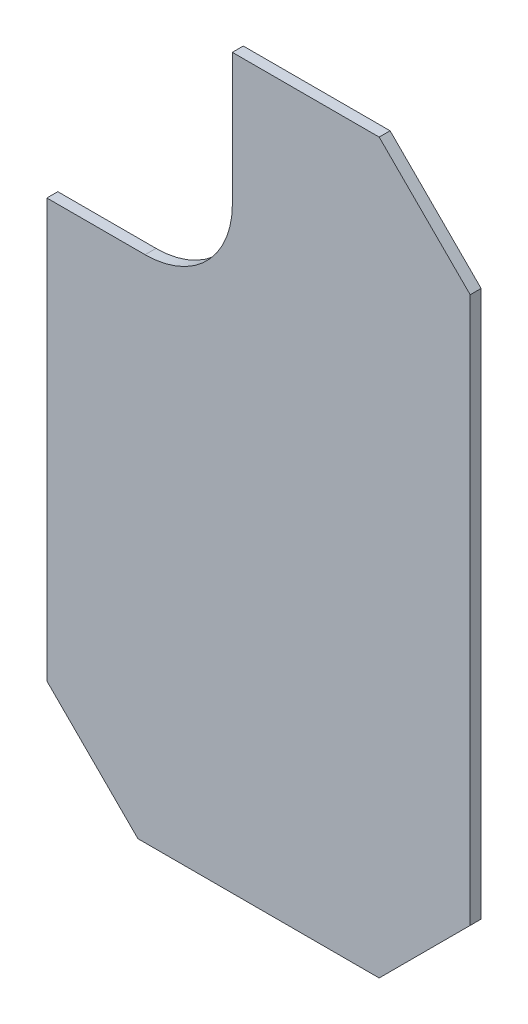
ISO-10303-21;
HEADER;
FILE_DESCRIPTION(('STEP AP214'),'2;1');
FILE_NAME('part.step','',(''),(''),'','','');
FILE_SCHEMA(('AUTOMOTIVE_DESIGN { 1 0 10303 214 1 1 1 1 }'));
ENDSEC;
DATA;
#1=APPLICATION_CONTEXT('core data for automotive mechanical design processes');
#2=APPLICATION_PROTOCOL_DEFINITION('international standard','automotive_design',2000,#1);
#3=PRODUCT_CONTEXT('',#1,'mechanical');
#4=PRODUCT('Part','Part','',(#3));
#5=PRODUCT_RELATED_PRODUCT_CATEGORY('part','',(#4));
#6=PRODUCT_DEFINITION_FORMATION('','',#4);
#7=PRODUCT_DEFINITION_CONTEXT('part definition',#1,'design');
#8=PRODUCT_DEFINITION('design','',#6,#7);
#9=PRODUCT_DEFINITION_SHAPE('','',#8);
#10=(LENGTH_UNIT() NAMED_UNIT(*) SI_UNIT(.MILLI.,.METRE.));
#11=(NAMED_UNIT(*) PLANE_ANGLE_UNIT() SI_UNIT($,.RADIAN.));
#12=(NAMED_UNIT(*) SI_UNIT($,.STERADIAN.) SOLID_ANGLE_UNIT());
#13=UNCERTAINTY_MEASURE_WITH_UNIT(LENGTH_MEASURE(1.E-05),#10,'distance_accuracy_value','');
#14=(GEOMETRIC_REPRESENTATION_CONTEXT(3) GLOBAL_UNCERTAINTY_ASSIGNED_CONTEXT((#13)) GLOBAL_UNIT_ASSIGNED_CONTEXT((#10,
#11,#12)) REPRESENTATION_CONTEXT('',''));
#15=CARTESIAN_POINT('',(0.,0.,0.));
#16=DIRECTION('',(0.,0.,1.));
#17=DIRECTION('',(1.,0.,0.));
#18=AXIS2_PLACEMENT_3D('',#15,#16,#17);
#19=CARTESIAN_POINT('',(-44.8224999999998,-89.4160782442633,0.762));
#20=DIRECTION('',(-0.707106781186544,0.70710678118655,0.));
#21=DIRECTION('',(-0.707106781186551,-0.707106781186544,0.));
#22=AXIS2_PLACEMENT_3D('',#19,#20,#21);
#23=PLANE('',#22);
#24=DIRECTION('',(0.707106781186551,0.707106781186544,0.));
#25=VECTOR('',#24,1.);
#26=CARTESIAN_POINT('',(-44.8224999999998,-89.4160782442633,0.));
#27=LINE('',#26,#25);
#28=CARTESIAN_POINT('',(-51.1724999999998,-95.7660782442633,0.));
#29=VERTEX_POINT('',#28);
#30=CARTESIAN_POINT('',(-44.8224999999998,-89.4160782442633,0.));
#31=VERTEX_POINT('',#30);
#32=EDGE_CURVE('E141',#29,#31,#27,.T.);
#33=ORIENTED_EDGE('',*,*,#32,.T.);
#34=DIRECTION('',(0.,0.,-1.));
#35=VECTOR('',#34,1.);
#36=CARTESIAN_POINT('',(-44.8224999999998,-89.4160782442633,0.762));
#37=LINE('',#36,#35);
#38=CARTESIAN_POINT('',(-44.8224999999998,-89.4160782442633,0.762));
#39=VERTEX_POINT('',#38);
#40=EDGE_CURVE('E11',#39,#31,#37,.T.);
#41=ORIENTED_EDGE('',*,*,#40,.F.);
#42=DIRECTION('',(0.707106781186551,0.707106781186544,0.));
#43=VECTOR('',#42,1.);
#44=CARTESIAN_POINT('',(-44.8224999999998,-89.4160782442633,0.762));
#45=LINE('',#44,#43);
#46=CARTESIAN_POINT('',(-51.1724999999998,-95.7660782442633,0.762));
#47=VERTEX_POINT('',#46);
#48=EDGE_CURVE('E159',#47,#39,#45,.T.);
#49=ORIENTED_EDGE('',*,*,#48,.F.);
#50=DIRECTION('',(0.,0.,-1.));
#51=VECTOR('',#50,1.);
#52=CARTESIAN_POINT('',(-51.1724999999998,-95.7660782442633,0.762));
#53=LINE('',#52,#51);
#54=EDGE_CURVE('E137',#47,#29,#53,.T.);
#55=ORIENTED_EDGE('',*,*,#54,.T.);
#56=EDGE_LOOP('',(#33,#41,#49,#55));
#57=FACE_BOUND('',#56,.T.);
#58=ADVANCED_FACE('F33',(#57),#23,.F.);
#59=CARTESIAN_POINT('',(-44.8224999999998,-51.3160782442633,0.762));
#60=DIRECTION('',(-1.,0.,0.));
#61=DIRECTION('',(0.,-1.,0.));
#62=AXIS2_PLACEMENT_3D('',#59,#60,#61);
#63=PLANE('',#62);
#64=DIRECTION('',(0.,1.,0.));
#65=VECTOR('',#64,1.);
#66=CARTESIAN_POINT('',(-44.8224999999998,-51.3160782442633,0.));
#67=LINE('',#66,#65);
#68=CARTESIAN_POINT('',(-44.8224999999998,-51.3160782442633,0.));
#69=VERTEX_POINT('',#68);
#70=EDGE_CURVE('E144',#31,#69,#67,.T.);
#71=ORIENTED_EDGE('',*,*,#70,.T.);
#72=DIRECTION('',(0.,0.,-1.));
#73=VECTOR('',#72,1.);
#74=CARTESIAN_POINT('',(-44.8224999999998,-51.3160782442633,0.762));
#75=LINE('',#74,#73);
#76=CARTESIAN_POINT('',(-44.8224999999998,-51.3160782442633,0.762));
#77=VERTEX_POINT('',#76);
#78=EDGE_CURVE('E41',#77,#69,#75,.T.);
#79=ORIENTED_EDGE('',*,*,#78,.F.);
#80=DIRECTION('',(0.,1.,0.));
#81=VECTOR('',#80,1.);
#82=CARTESIAN_POINT('',(-44.8224999999998,-51.3160782442633,0.762));
#83=LINE('',#82,#81);
#84=EDGE_CURVE('E98',#39,#77,#83,.T.);
#85=ORIENTED_EDGE('',*,*,#84,.F.);
#86=ORIENTED_EDGE('',*,*,#40,.T.);
#87=EDGE_LOOP('',(#71,#79,#85,#86));
#88=FACE_BOUND('',#87,.T.);
#89=ADVANCED_FACE('F208',(#88),#63,.F.);
#90=CARTESIAN_POINT('',(-51.1724999999998,-44.9660782442633,0.762));
#91=DIRECTION('',(-0.707106781186546,-0.707106781186549,0.));
#92=DIRECTION('',(0.707106781186549,-0.707106781186546,0.));
#93=AXIS2_PLACEMENT_3D('',#90,#91,#92);
#94=PLANE('',#93);
#95=DIRECTION('',(-0.707106781186549,0.707106781186546,0.));
#96=VECTOR('',#95,1.);
#97=CARTESIAN_POINT('',(-51.1724999999998,-44.9660782442633,0.));
#98=LINE('',#97,#96);
#99=CARTESIAN_POINT('',(-51.1724999999998,-44.9660782442633,0.));
#100=VERTEX_POINT('',#99);
#101=EDGE_CURVE('E146',#69,#100,#98,.T.);
#102=ORIENTED_EDGE('',*,*,#101,.T.);
#103=DIRECTION('',(0.,0.,-1.));
#104=VECTOR('',#103,1.);
#105=CARTESIAN_POINT('',(-51.1724999999998,-44.9660782442633,0.762));
#106=LINE('',#105,#104);
#107=CARTESIAN_POINT('',(-51.1724999999998,-44.9660782442633,0.762));
#108=VERTEX_POINT('',#107);
#109=EDGE_CURVE('E172',#108,#100,#106,.T.);
#110=ORIENTED_EDGE('',*,*,#109,.F.);
#111=DIRECTION('',(-0.707106781186549,0.707106781186546,0.));
#112=VECTOR('',#111,1.);
#113=CARTESIAN_POINT('',(-51.1724999999998,-44.9660782442633,0.762));
#114=LINE('',#113,#112);
#115=EDGE_CURVE('E180',#77,#108,#114,.T.);
#116=ORIENTED_EDGE('',*,*,#115,.F.);
#117=ORIENTED_EDGE('',*,*,#78,.T.);
#118=EDGE_LOOP('',(#102,#110,#116,#117));
#119=FACE_BOUND('',#118,.T.);
#120=ADVANCED_FACE('F178',(#119),#94,.F.);
#121=CARTESIAN_POINT('',(-61.4124999999999,-44.9660782442633,0.762));
#122=DIRECTION('',(0.,-1.,0.));
#123=DIRECTION('',(1.,0.,0.));
#124=AXIS2_PLACEMENT_3D('',#121,#122,#123);
#125=PLANE('',#124);
#126=DIRECTION('',(-1.,0.,0.));
#127=VECTOR('',#126,1.);
#128=CARTESIAN_POINT('',(-61.4124999999999,-44.9660782442633,0.));
#129=LINE('',#128,#127);
#130=CARTESIAN_POINT('',(-61.4124999999999,-44.9660782442633,0.));
#131=VERTEX_POINT('',#130);
#132=EDGE_CURVE('E148',#100,#131,#129,.T.);
#133=ORIENTED_EDGE('',*,*,#132,.T.);
#134=DIRECTION('',(0.,0.,-1.));
#135=VECTOR('',#134,1.);
#136=CARTESIAN_POINT('',(-61.4124999999999,-44.9660782442633,0.762));
#137=LINE('',#136,#135);
#138=CARTESIAN_POINT('',(-61.4124999999999,-44.9660782442633,0.762));
#139=VERTEX_POINT('',#138);
#140=EDGE_CURVE('E169',#139,#131,#137,.T.);
#141=ORIENTED_EDGE('',*,*,#140,.F.);
#142=DIRECTION('',(-1.,0.,0.));
#143=VECTOR('',#142,1.);
#144=CARTESIAN_POINT('',(-61.4124999999999,-44.9660782442633,0.762));
#145=LINE('',#144,#143);
#146=EDGE_CURVE('E198',#108,#139,#145,.T.);
#147=ORIENTED_EDGE('',*,*,#146,.F.);
#148=ORIENTED_EDGE('',*,*,#109,.T.);
#149=EDGE_LOOP('',(#133,#141,#147,#148));
#150=FACE_BOUND('',#149,.T.);
#151=ADVANCED_FACE('F189',(#150),#125,.F.);
#152=CARTESIAN_POINT('',(-61.4124999999999,-54.1471547276613,0.762));
#153=DIRECTION('',(1.,0.,0.));
#154=DIRECTION('',(0.,0.,-1.));
#155=AXIS2_PLACEMENT_3D('',#152,#153,#154);
#156=PLANE('',#155);
#157=DIRECTION('',(0.,-1.,0.));
#158=VECTOR('',#157,1.);
#159=CARTESIAN_POINT('',(-61.4124999999999,-54.1471547276613,0.));
#160=LINE('',#159,#158);
#161=CARTESIAN_POINT('',(-61.4124999999999,-54.1471547276613,0.));
#162=VERTEX_POINT('',#161);
#163=EDGE_CURVE('E150',#131,#162,#160,.T.);
#164=ORIENTED_EDGE('',*,*,#163,.T.);
#165=DIRECTION('',(0.,0.,-1.));
#166=VECTOR('',#165,1.);
#167=CARTESIAN_POINT('',(-61.4124999999999,-54.1471547276613,0.762));
#168=LINE('',#167,#166);
#169=CARTESIAN_POINT('',(-61.4124999999999,-54.1471547276613,0.762));
#170=VERTEX_POINT('',#169);
#171=EDGE_CURVE('E166',#170,#162,#168,.T.);
#172=ORIENTED_EDGE('',*,*,#171,.F.);
#173=DIRECTION('',(0.,-1.,0.));
#174=VECTOR('',#173,1.);
#175=CARTESIAN_POINT('',(-61.4124999999999,-54.1471547276613,0.762));
#176=LINE('',#175,#174);
#177=EDGE_CURVE('E195',#139,#170,#176,.T.);
#178=ORIENTED_EDGE('',*,*,#177,.F.);
#179=ORIENTED_EDGE('',*,*,#140,.T.);
#180=EDGE_LOOP('',(#164,#172,#178,#179));
#181=FACE_BOUND('',#180,.T.);
#182=ADVANCED_FACE('F193',(#181),#156,.F.);
#183=CARTESIAN_POINT('',(-67.4999999999999,-54.1471547276613,0.762));
#184=DIRECTION('',(0.,0.,-1.));
#185=DIRECTION('',(-1.,0.,0.));
#186=AXIS2_PLACEMENT_3D('',#183,#184,#185);
#187=CYLINDRICAL_SURFACE('',#186,6.0875);
#188=CARTESIAN_POINT('',(-67.4999999999999,-54.1471547276613,0.));
#189=DIRECTION('',(0.,0.,-1.));
#190=DIRECTION('',(1.,0.,0.));
#191=AXIS2_PLACEMENT_3D('',#188,#189,#190);
#192=CIRCLE('',#191,6.0875);
#193=CARTESIAN_POINT('',(-67.4999999999999,-60.2346547276613,0.));
#194=VERTEX_POINT('',#193);
#195=EDGE_CURVE('E152',#162,#194,#192,.T.);
#196=ORIENTED_EDGE('',*,*,#195,.T.);
#197=DIRECTION('',(0.,0.,-1.));
#198=VECTOR('',#197,1.);
#199=CARTESIAN_POINT('',(-67.4999999999999,-60.2346547276613,0.762));
#200=LINE('',#199,#198);
#201=CARTESIAN_POINT('',(-67.4999999999999,-60.2346547276613,0.762));
#202=VERTEX_POINT('',#201);
#203=EDGE_CURVE('E163',#202,#194,#200,.T.);
#204=ORIENTED_EDGE('',*,*,#203,.F.);
#205=CARTESIAN_POINT('',(-67.4999999999999,-54.1471547276613,0.762));
#206=DIRECTION('',(0.,0.,-1.));
#207=DIRECTION('',(1.,0.,0.));
#208=AXIS2_PLACEMENT_3D('',#205,#206,#207);
#209=CIRCLE('',#208,6.0875);
#210=EDGE_CURVE('E197',#170,#202,#209,.T.);
#211=ORIENTED_EDGE('',*,*,#210,.F.);
#212=ORIENTED_EDGE('',*,*,#171,.T.);
#213=EDGE_LOOP('',(#196,#204,#211,#212));
#214=FACE_BOUND('',#213,.T.);
#215=ADVANCED_FACE('F220',(#214),#187,.F.);
#216=CARTESIAN_POINT('',(-74.3499999999998,-60.2346547276613,0.762));
#217=DIRECTION('',(0.,-1.,0.));
#218=DIRECTION('',(1.,0.,0.));
#219=AXIS2_PLACEMENT_3D('',#216,#217,#218);
#220=PLANE('',#219);
#221=DIRECTION('',(-1.,0.,0.));
#222=VECTOR('',#221,1.);
#223=CARTESIAN_POINT('',(-74.3499999999998,-60.2346547276613,0.));
#224=LINE('',#223,#222);
#225=CARTESIAN_POINT('',(-74.3499999999998,-60.2346547276613,0.));
#226=VERTEX_POINT('',#225);
#227=EDGE_CURVE('E154',#194,#226,#224,.T.);
#228=ORIENTED_EDGE('',*,*,#227,.T.);
#229=DIRECTION('',(0.,0.,-1.));
#230=VECTOR('',#229,1.);
#231=CARTESIAN_POINT('',(-74.3499999999998,-60.2346547276613,0.762));
#232=LINE('',#231,#230);
#233=CARTESIAN_POINT('',(-74.3499999999998,-60.2346547276613,0.762));
#234=VERTEX_POINT('',#233);
#235=EDGE_CURVE('E132',#234,#226,#232,.T.);
#236=ORIENTED_EDGE('',*,*,#235,.F.);
#237=DIRECTION('',(-1.,0.,0.));
#238=VECTOR('',#237,1.);
#239=CARTESIAN_POINT('',(-74.3499999999998,-60.2346547276613,0.762));
#240=LINE('',#239,#238);
#241=EDGE_CURVE('E123',#202,#234,#240,.T.);
#242=ORIENTED_EDGE('',*,*,#241,.F.);
#243=ORIENTED_EDGE('',*,*,#203,.T.);
#244=EDGE_LOOP('',(#228,#236,#242,#243));
#245=FACE_BOUND('',#244,.T.);
#246=ADVANCED_FACE('F223',(#245),#220,.F.);
#247=CARTESIAN_POINT('',(-74.3499999999998,-89.4160782442633,0.762));
#248=DIRECTION('',(1.,0.,0.));
#249=DIRECTION('',(0.,0.,-1.));
#250=AXIS2_PLACEMENT_3D('',#247,#248,#249);
#251=PLANE('',#250);
#252=DIRECTION('',(0.,-1.,0.));
#253=VECTOR('',#252,1.);
#254=CARTESIAN_POINT('',(-74.3499999999998,-89.4160782442633,0.));
#255=LINE('',#254,#253);
#256=CARTESIAN_POINT('',(-74.3499999999998,-89.4160782442633,0.));
#257=VERTEX_POINT('',#256);
#258=EDGE_CURVE('E131',#226,#257,#255,.T.);
#259=ORIENTED_EDGE('',*,*,#258,.T.);
#260=DIRECTION('',(0.,0.,-1.));
#261=VECTOR('',#260,1.);
#262=CARTESIAN_POINT('',(-74.3499999999998,-89.4160782442633,0.762));
#263=LINE('',#262,#261);
#264=CARTESIAN_POINT('',(-74.3499999999998,-89.4160782442633,0.762));
#265=VERTEX_POINT('',#264);
#266=EDGE_CURVE('E128',#265,#257,#263,.T.);
#267=ORIENTED_EDGE('',*,*,#266,.F.);
#268=DIRECTION('',(0.,-1.,0.));
#269=VECTOR('',#268,1.);
#270=CARTESIAN_POINT('',(-74.3499999999998,-89.4160782442633,0.762));
#271=LINE('',#270,#269);
#272=EDGE_CURVE('E117',#234,#265,#271,.T.);
#273=ORIENTED_EDGE('',*,*,#272,.F.);
#274=ORIENTED_EDGE('',*,*,#235,.T.);
#275=EDGE_LOOP('',(#259,#267,#273,#274));
#276=FACE_BOUND('',#275,.T.);
#277=ADVANCED_FACE('F129',(#276),#251,.F.);
#278=CARTESIAN_POINT('',(-67.9999999999997,-95.7660782442633,0.762));
#279=DIRECTION('',(0.707106781186546,0.707106781186549,0.));
#280=DIRECTION('',(-0.707106781186549,0.707106781186546,0.));
#281=AXIS2_PLACEMENT_3D('',#278,#279,#280);
#282=PLANE('',#281);
#283=DIRECTION('',(0.707106781186549,-0.707106781186546,0.));
#284=VECTOR('',#283,1.);
#285=CARTESIAN_POINT('',(-67.9999999999997,-95.7660782442633,0.));
#286=LINE('',#285,#284);
#287=CARTESIAN_POINT('',(-67.9999999999997,-95.7660782442633,0.));
#288=VERTEX_POINT('',#287);
#289=EDGE_CURVE('E84',#257,#288,#286,.T.);
#290=ORIENTED_EDGE('',*,*,#289,.T.);
#291=DIRECTION('',(0.,0.,-1.));
#292=VECTOR('',#291,1.);
#293=CARTESIAN_POINT('',(-67.9999999999997,-95.7660782442633,0.762));
#294=LINE('',#293,#292);
#295=CARTESIAN_POINT('',(-67.9999999999997,-95.7660782442633,0.762));
#296=VERTEX_POINT('',#295);
#297=EDGE_CURVE('E133',#296,#288,#294,.T.);
#298=ORIENTED_EDGE('',*,*,#297,.F.);
#299=DIRECTION('',(0.707106781186549,-0.707106781186546,0.));
#300=VECTOR('',#299,1.);
#301=CARTESIAN_POINT('',(-67.9999999999997,-95.7660782442633,0.762));
#302=LINE('',#301,#300);
#303=EDGE_CURVE('E121',#265,#296,#302,.T.);
#304=ORIENTED_EDGE('',*,*,#303,.F.);
#305=ORIENTED_EDGE('',*,*,#266,.T.);
#306=EDGE_LOOP('',(#290,#298,#304,#305));
#307=FACE_BOUND('',#306,.T.);
#308=ADVANCED_FACE('F135',(#307),#282,.F.);
#309=CARTESIAN_POINT('',(-51.1724999999998,-95.7660782442633,0.762));
#310=DIRECTION('',(0.,1.,0.));
#311=DIRECTION('',(-1.,0.,0.));
#312=AXIS2_PLACEMENT_3D('',#309,#310,#311);
#313=PLANE('',#312);
#314=DIRECTION('',(1.,0.,0.));
#315=VECTOR('',#314,1.);
#316=CARTESIAN_POINT('',(-51.1724999999998,-95.7660782442633,0.));
#317=LINE('',#316,#315);
#318=EDGE_CURVE('E90',#288,#29,#317,.T.);
#319=ORIENTED_EDGE('',*,*,#318,.T.);
#320=ORIENTED_EDGE('',*,*,#54,.F.);
#321=DIRECTION('',(1.,0.,0.));
#322=VECTOR('',#321,1.);
#323=CARTESIAN_POINT('',(-51.1724999999998,-95.7660782442633,0.762));
#324=LINE('',#323,#322);
#325=EDGE_CURVE('E49',#296,#47,#324,.T.);
#326=ORIENTED_EDGE('',*,*,#325,.F.);
#327=ORIENTED_EDGE('',*,*,#297,.T.);
#328=EDGE_LOOP('',(#319,#320,#326,#327));
#329=FACE_BOUND('',#328,.T.);
#330=ADVANCED_FACE('F232',(#329),#313,.F.);
#331=CARTESIAN_POINT('',(-67.4999999999999,-54.1471547276613,0.762));
#332=DIRECTION('',(0.,0.,1.));
#333=DIRECTION('',(1.,0.,0.));
#334=AXIS2_PLACEMENT_3D('',#331,#332,#333);
#335=PLANE('',#334);
#336=ORIENTED_EDGE('',*,*,#48,.T.);
#337=ORIENTED_EDGE('',*,*,#84,.T.);
#338=ORIENTED_EDGE('',*,*,#115,.T.);
#339=ORIENTED_EDGE('',*,*,#146,.T.);
#340=ORIENTED_EDGE('',*,*,#177,.T.);
#341=ORIENTED_EDGE('',*,*,#210,.T.);
#342=ORIENTED_EDGE('',*,*,#241,.T.);
#343=ORIENTED_EDGE('',*,*,#272,.T.);
#344=ORIENTED_EDGE('',*,*,#303,.T.);
#345=ORIENTED_EDGE('',*,*,#325,.T.);
#346=EDGE_LOOP('',(#336,#337,#338,#339,#340,#341,#342,#343,#344,#345));
#347=FACE_BOUND('',#346,.T.);
#348=ADVANCED_FACE('F119',(#347),#335,.T.);
#349=CARTESIAN_POINT('',(-67.4999999999999,-54.1471547276613,0.));
#350=DIRECTION('',(0.,0.,1.));
#351=DIRECTION('',(1.,0.,0.));
#352=AXIS2_PLACEMENT_3D('',#349,#350,#351);
#353=PLANE('',#352);
#354=ORIENTED_EDGE('',*,*,#32,.F.);
#355=ORIENTED_EDGE('',*,*,#318,.F.);
#356=ORIENTED_EDGE('',*,*,#289,.F.);
#357=ORIENTED_EDGE('',*,*,#258,.F.);
#358=ORIENTED_EDGE('',*,*,#227,.F.);
#359=ORIENTED_EDGE('',*,*,#195,.F.);
#360=ORIENTED_EDGE('',*,*,#163,.F.);
#361=ORIENTED_EDGE('',*,*,#132,.F.);
#362=ORIENTED_EDGE('',*,*,#101,.F.);
#363=ORIENTED_EDGE('',*,*,#70,.F.);
#364=EDGE_LOOP('',(#354,#355,#356,#357,#358,#359,#360,#361,#362,#363));
#365=FACE_BOUND('',#364,.T.);
#366=ADVANCED_FACE('F184',(#365),#353,.F.);
#367=CLOSED_SHELL('',(#58,#89,#120,#151,#182,#215,#246,#277,#308,#330,#348,#366));
#368=MANIFOLD_SOLID_BREP('B2',#367);
#369=ADVANCED_BREP_SHAPE_REPRESENTATION('',(#18,#368),#14);
#370=SHAPE_DEFINITION_REPRESENTATION(#9,#369);
ENDSEC;
END-ISO-10303-21;
